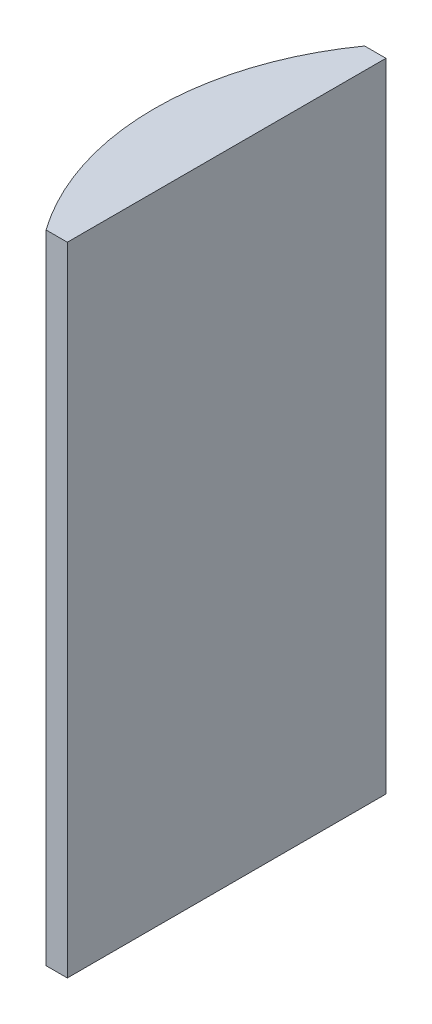
ISO-10303-21;
HEADER;
FILE_DESCRIPTION(('STEP AP214'),'2;1');
FILE_NAME('part.step','',(''),(''),'','','');
FILE_SCHEMA(('AUTOMOTIVE_DESIGN { 1 0 10303 214 1 1 1 1 }'));
ENDSEC;
DATA;
#1=APPLICATION_CONTEXT('core data for automotive mechanical design processes');
#2=APPLICATION_PROTOCOL_DEFINITION('international standard','automotive_design',2000,#1);
#3=PRODUCT_CONTEXT('',#1,'mechanical');
#4=PRODUCT('Part','Part','',(#3));
#5=PRODUCT_RELATED_PRODUCT_CATEGORY('part','',(#4));
#6=PRODUCT_DEFINITION_FORMATION('','',#4);
#7=PRODUCT_DEFINITION_CONTEXT('part definition',#1,'design');
#8=PRODUCT_DEFINITION('design','',#6,#7);
#9=PRODUCT_DEFINITION_SHAPE('','',#8);
#10=(LENGTH_UNIT() NAMED_UNIT(*) SI_UNIT(.MILLI.,.METRE.));
#11=(NAMED_UNIT(*) PLANE_ANGLE_UNIT() SI_UNIT($,.RADIAN.));
#12=(NAMED_UNIT(*) SI_UNIT($,.STERADIAN.) SOLID_ANGLE_UNIT());
#13=UNCERTAINTY_MEASURE_WITH_UNIT(LENGTH_MEASURE(1.E-05),#10,'distance_accuracy_value','');
#14=(GEOMETRIC_REPRESENTATION_CONTEXT(3) GLOBAL_UNCERTAINTY_ASSIGNED_CONTEXT((#13)) GLOBAL_UNIT_ASSIGNED_CONTEXT((#10,
#11,#12)) REPRESENTATION_CONTEXT('',''));
#15=CARTESIAN_POINT('',(0.,0.,0.));
#16=DIRECTION('',(0.,0.,1.));
#17=DIRECTION('',(1.,0.,0.));
#18=AXIS2_PLACEMENT_3D('',#15,#16,#17);
#19=CARTESIAN_POINT('',(4.35520433485127,60.,0.));
#20=DIRECTION('',(0.,-1.,0.));
#21=DIRECTION('',(0.,0.,-1.));
#22=AXIS2_PLACEMENT_3D('',#19,#20,#21);
#23=CYLINDRICAL_SURFACE('',#22,25.85);
#24=CARTESIAN_POINT('',(4.35520433485127,0.,0.));
#25=DIRECTION('',(0.,1.,0.));
#26=DIRECTION('',(0.,0.,1.));
#27=AXIS2_PLACEMENT_3D('',#24,#25,#26);
#28=CIRCLE('',#27,25.85);
#29=CARTESIAN_POINT('',(-16.6976458284877,0.,-15.));
#30=VERTEX_POINT('',#29);
#31=CARTESIAN_POINT('',(-16.6976458284877,0.,15.));
#32=VERTEX_POINT('',#31);
#33=EDGE_CURVE('E100',#30,#32,#28,.T.);
#34=ORIENTED_EDGE('',*,*,#33,.T.);
#35=DIRECTION('',(0.,-1.,0.));
#36=VECTOR('',#35,1.);
#37=CARTESIAN_POINT('',(-16.6976458284877,60.,15.));
#38=LINE('',#37,#36);
#39=CARTESIAN_POINT('',(-16.6976458284877,60.,15.));
#40=VERTEX_POINT('',#39);
#41=EDGE_CURVE('E11',#40,#32,#38,.T.);
#42=ORIENTED_EDGE('',*,*,#41,.F.);
#43=CARTESIAN_POINT('',(4.35520433485127,60.,0.));
#44=DIRECTION('',(0.,1.,0.));
#45=DIRECTION('',(0.,0.,1.));
#46=AXIS2_PLACEMENT_3D('',#43,#44,#45);
#47=CIRCLE('',#46,25.85);
#48=CARTESIAN_POINT('',(-16.6976458284877,60.,-15.));
#49=VERTEX_POINT('',#48);
#50=EDGE_CURVE('E88',#49,#40,#47,.T.);
#51=ORIENTED_EDGE('',*,*,#50,.F.);
#52=DIRECTION('',(0.,-1.,0.));
#53=VECTOR('',#52,1.);
#54=CARTESIAN_POINT('',(-16.6976458284877,60.,-15.));
#55=LINE('',#54,#53);
#56=EDGE_CURVE('E96',#49,#30,#55,.T.);
#57=ORIENTED_EDGE('',*,*,#56,.T.);
#58=EDGE_LOOP('',(#34,#42,#51,#57));
#59=FACE_BOUND('',#58,.T.);
#60=ADVANCED_FACE('F37',(#59),#23,.T.);
#61=CARTESIAN_POINT('',(-16.6976458284877,60.,15.));
#62=DIRECTION('',(0.,0.,-1.));
#63=DIRECTION('',(-1.,0.,0.));
#64=AXIS2_PLACEMENT_3D('',#61,#62,#63);
#65=PLANE('',#64);
#66=DIRECTION('',(1.,0.,0.));
#67=VECTOR('',#66,1.);
#68=CARTESIAN_POINT('',(-16.6976458284877,0.,15.));
#69=LINE('',#68,#67);
#70=CARTESIAN_POINT('',(-14.6947956651487,0.,15.));
#71=VERTEX_POINT('',#70);
#72=EDGE_CURVE('E92',#32,#71,#69,.T.);
#73=ORIENTED_EDGE('',*,*,#72,.T.);
#74=DIRECTION('',(0.,-1.,0.));
#75=VECTOR('',#74,1.);
#76=CARTESIAN_POINT('',(-14.6947956651487,60.,15.));
#77=LINE('',#76,#75);
#78=CARTESIAN_POINT('',(-14.6947956651487,60.,15.));
#79=VERTEX_POINT('',#78);
#80=EDGE_CURVE('E45',#79,#71,#77,.T.);
#81=ORIENTED_EDGE('',*,*,#80,.F.);
#82=DIRECTION('',(1.,0.,0.));
#83=VECTOR('',#82,1.);
#84=CARTESIAN_POINT('',(-16.6976458284877,60.,15.));
#85=LINE('',#84,#83);
#86=EDGE_CURVE('E83',#40,#79,#85,.T.);
#87=ORIENTED_EDGE('',*,*,#86,.F.);
#88=ORIENTED_EDGE('',*,*,#41,.T.);
#89=EDGE_LOOP('',(#73,#81,#87,#88));
#90=FACE_BOUND('',#89,.T.);
#91=ADVANCED_FACE('F91',(#90),#65,.F.);
#92=CARTESIAN_POINT('',(-14.6947956651487,60.,-15.));
#93=DIRECTION('',(-1.,0.,0.));
#94=DIRECTION('',(0.,0.,1.));
#95=AXIS2_PLACEMENT_3D('',#92,#93,#94);
#96=PLANE('',#95);
#97=DIRECTION('',(0.,0.,-1.));
#98=VECTOR('',#97,1.);
#99=CARTESIAN_POINT('',(-14.6947956651487,0.,-15.));
#100=LINE('',#99,#98);
#101=CARTESIAN_POINT('',(-14.6947956651487,0.,-15.));
#102=VERTEX_POINT('',#101);
#103=EDGE_CURVE('E70',#71,#102,#100,.T.);
#104=ORIENTED_EDGE('',*,*,#103,.T.);
#105=DIRECTION('',(0.,-1.,0.));
#106=VECTOR('',#105,1.);
#107=CARTESIAN_POINT('',(-14.6947956651487,60.,-15.));
#108=LINE('',#107,#106);
#109=CARTESIAN_POINT('',(-14.6947956651487,60.,-15.));
#110=VERTEX_POINT('',#109);
#111=EDGE_CURVE('E93',#110,#102,#108,.T.);
#112=ORIENTED_EDGE('',*,*,#111,.F.);
#113=DIRECTION('',(0.,0.,-1.));
#114=VECTOR('',#113,1.);
#115=CARTESIAN_POINT('',(-14.6947956651487,60.,-15.));
#116=LINE('',#115,#114);
#117=EDGE_CURVE('E86',#79,#110,#116,.T.);
#118=ORIENTED_EDGE('',*,*,#117,.F.);
#119=ORIENTED_EDGE('',*,*,#80,.T.);
#120=EDGE_LOOP('',(#104,#112,#118,#119));
#121=FACE_BOUND('',#120,.T.);
#122=ADVANCED_FACE('F94',(#121),#96,.F.);
#123=CARTESIAN_POINT('',(-16.6976458284877,60.,-15.));
#124=DIRECTION('',(0.,0.,1.));
#125=DIRECTION('',(1.,0.,0.));
#126=AXIS2_PLACEMENT_3D('',#123,#124,#125);
#127=PLANE('',#126);
#128=DIRECTION('',(-1.,0.,0.));
#129=VECTOR('',#128,1.);
#130=CARTESIAN_POINT('',(-16.6976458284877,0.,-15.));
#131=LINE('',#130,#129);
#132=EDGE_CURVE('E76',#102,#30,#131,.T.);
#133=ORIENTED_EDGE('',*,*,#132,.T.);
#134=ORIENTED_EDGE('',*,*,#56,.F.);
#135=DIRECTION('',(-1.,0.,0.));
#136=VECTOR('',#135,1.);
#137=CARTESIAN_POINT('',(-16.6976458284877,60.,-15.));
#138=LINE('',#137,#136);
#139=EDGE_CURVE('E53',#110,#49,#138,.T.);
#140=ORIENTED_EDGE('',*,*,#139,.F.);
#141=ORIENTED_EDGE('',*,*,#111,.T.);
#142=EDGE_LOOP('',(#133,#134,#140,#141));
#143=FACE_BOUND('',#142,.T.);
#144=ADVANCED_FACE('F107',(#143),#127,.F.);
#145=CARTESIAN_POINT('',(4.35520433485127,60.,0.));
#146=DIRECTION('',(0.,1.,0.));
#147=DIRECTION('',(0.,0.,1.));
#148=AXIS2_PLACEMENT_3D('',#145,#146,#147);
#149=PLANE('',#148);
#150=ORIENTED_EDGE('',*,*,#50,.T.);
#151=ORIENTED_EDGE('',*,*,#86,.T.);
#152=ORIENTED_EDGE('',*,*,#117,.T.);
#153=ORIENTED_EDGE('',*,*,#139,.T.);
#154=EDGE_LOOP('',(#150,#151,#152,#153));
#155=FACE_BOUND('',#154,.T.);
#156=ADVANCED_FACE('F84',(#155),#149,.T.);
#157=CARTESIAN_POINT('',(4.35520433485127,0.,0.));
#158=DIRECTION('',(0.,1.,0.));
#159=DIRECTION('',(0.,0.,1.));
#160=AXIS2_PLACEMENT_3D('',#157,#158,#159);
#161=PLANE('',#160);
#162=ORIENTED_EDGE('',*,*,#33,.F.);
#163=ORIENTED_EDGE('',*,*,#132,.F.);
#164=ORIENTED_EDGE('',*,*,#103,.F.);
#165=ORIENTED_EDGE('',*,*,#72,.F.);
#166=EDGE_LOOP('',(#162,#163,#164,#165));
#167=FACE_BOUND('',#166,.T.);
#168=ADVANCED_FACE('F110',(#167),#161,.F.);
#169=CLOSED_SHELL('',(#60,#91,#122,#144,#156,#168));
#170=MANIFOLD_SOLID_BREP('B2',#169);
#171=ADVANCED_BREP_SHAPE_REPRESENTATION('',(#18,#170),#14);
#172=SHAPE_DEFINITION_REPRESENTATION(#9,#171);
ENDSEC;
END-ISO-10303-21;
